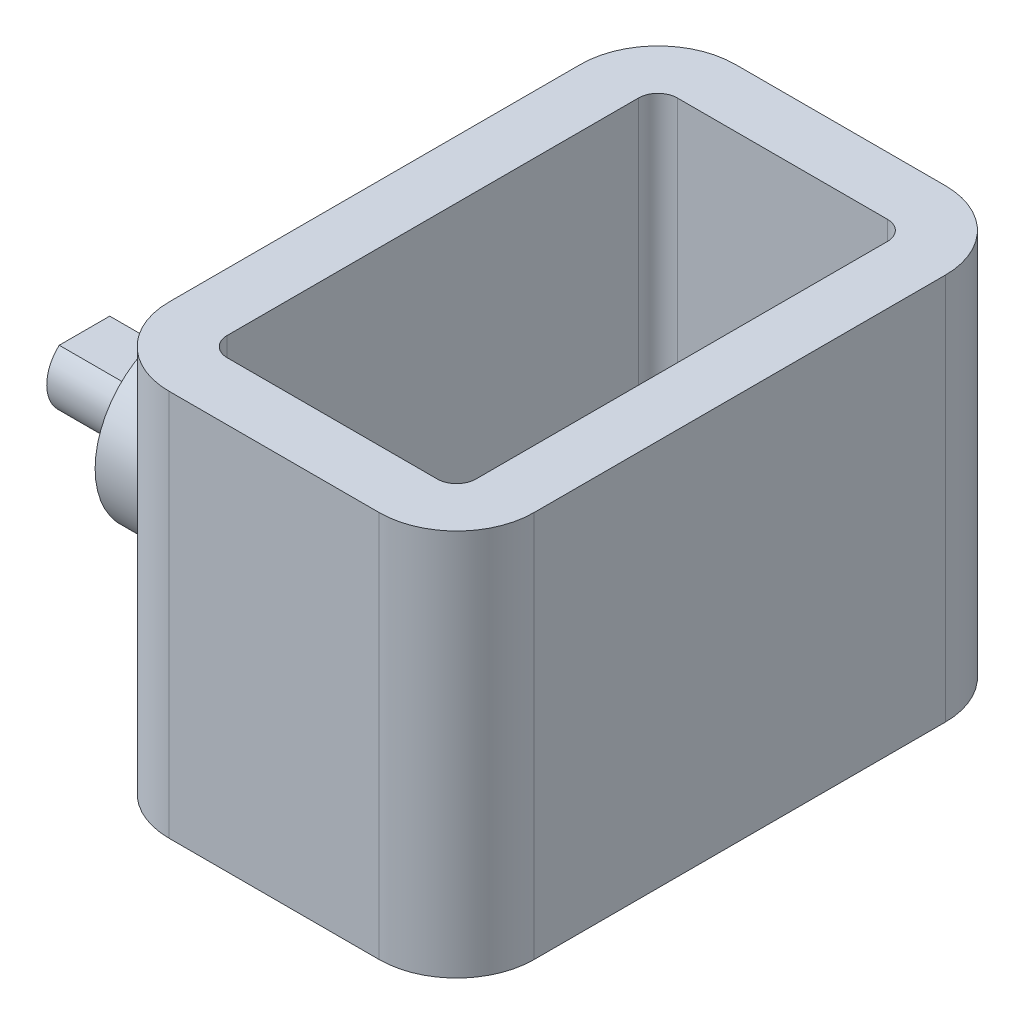
ISO-10303-21;
HEADER;
FILE_DESCRIPTION(('STEP AP214'),'2;1');
FILE_NAME('part.step','',(''),(''),'','','');
FILE_SCHEMA(('AUTOMOTIVE_DESIGN { 1 0 10303 214 1 1 1 1 }'));
ENDSEC;
DATA;
#1=APPLICATION_CONTEXT('core data for automotive mechanical design processes');
#2=APPLICATION_PROTOCOL_DEFINITION('international standard','automotive_design',2000,#1);
#3=PRODUCT_CONTEXT('',#1,'mechanical');
#4=PRODUCT('Part','Part','',(#3));
#5=PRODUCT_RELATED_PRODUCT_CATEGORY('part','',(#4));
#6=PRODUCT_DEFINITION_FORMATION('','',#4);
#7=PRODUCT_DEFINITION_CONTEXT('part definition',#1,'design');
#8=PRODUCT_DEFINITION('design','',#6,#7);
#9=PRODUCT_DEFINITION_SHAPE('','',#8);
#10=(LENGTH_UNIT() NAMED_UNIT(*) SI_UNIT(.MILLI.,.METRE.));
#11=(NAMED_UNIT(*) PLANE_ANGLE_UNIT() SI_UNIT($,.RADIAN.));
#12=(NAMED_UNIT(*) SI_UNIT($,.STERADIAN.) SOLID_ANGLE_UNIT());
#13=UNCERTAINTY_MEASURE_WITH_UNIT(LENGTH_MEASURE(1.E-05),#10,'distance_accuracy_value','');
#14=(GEOMETRIC_REPRESENTATION_CONTEXT(3) GLOBAL_UNCERTAINTY_ASSIGNED_CONTEXT((#13)) GLOBAL_UNIT_ASSIGNED_CONTEXT((#10,
#11,#12)) REPRESENTATION_CONTEXT('',''));
#15=CARTESIAN_POINT('',(0.,0.,0.));
#16=DIRECTION('',(0.,0.,1.));
#17=DIRECTION('',(1.,0.,0.));
#18=AXIS2_PLACEMENT_3D('',#15,#16,#17);
#19=CARTESIAN_POINT('',(-5.425,20.,-10.625));
#20=DIRECTION('',(0.,1.,0.));
#21=DIRECTION('',(0.,0.,1.));
#22=AXIS2_PLACEMENT_3D('',#19,#20,#21);
#23=PLANE('',#22);
#24=CARTESIAN_POINT('',(-5.425,20.,-10.625));
#25=DIRECTION('',(0.,1.,0.));
#26=DIRECTION('',(0.,0.,1.));
#27=AXIS2_PLACEMENT_3D('',#24,#25,#26);
#28=CIRCLE('',#27,4.);
#29=CARTESIAN_POINT('',(-5.425,20.,-14.625));
#30=VERTEX_POINT('',#29);
#31=CARTESIAN_POINT('',(-9.425,20.,-10.625));
#32=VERTEX_POINT('',#31);
#33=EDGE_CURVE('E288',#30,#32,#28,.T.);
#34=ORIENTED_EDGE('',*,*,#33,.T.);
#35=DIRECTION('',(0.,0.,1.));
#36=VECTOR('',#35,1.);
#37=CARTESIAN_POINT('',(-9.425,20.,-10.625));
#38=LINE('',#37,#36);
#39=CARTESIAN_POINT('',(-9.425,20.,10.625));
#40=VERTEX_POINT('',#39);
#41=EDGE_CURVE('E292',#32,#40,#38,.T.);
#42=ORIENTED_EDGE('',*,*,#41,.T.);
#43=CARTESIAN_POINT('',(-5.425,20.,10.625));
#44=DIRECTION('',(0.,1.,0.));
#45=DIRECTION('',(0.,0.,1.));
#46=AXIS2_PLACEMENT_3D('',#43,#44,#45);
#47=CIRCLE('',#46,4.);
#48=CARTESIAN_POINT('',(-5.425,20.,14.625));
#49=VERTEX_POINT('',#48);
#50=EDGE_CURVE('E296',#40,#49,#47,.T.);
#51=ORIENTED_EDGE('',*,*,#50,.T.);
#52=DIRECTION('',(1.,0.,0.));
#53=VECTOR('',#52,1.);
#54=CARTESIAN_POINT('',(-5.425,20.,14.625));
#55=LINE('',#54,#53);
#56=CARTESIAN_POINT('',(5.425,20.,14.625));
#57=VERTEX_POINT('',#56);
#58=EDGE_CURVE('E299',#49,#57,#55,.T.);
#59=ORIENTED_EDGE('',*,*,#58,.T.);
#60=CARTESIAN_POINT('',(5.425,20.,10.625));
#61=DIRECTION('',(0.,1.,0.));
#62=DIRECTION('',(0.,0.,1.));
#63=AXIS2_PLACEMENT_3D('',#60,#61,#62);
#64=CIRCLE('',#63,4.);
#65=CARTESIAN_POINT('',(9.425,20.,10.625));
#66=VERTEX_POINT('',#65);
#67=EDGE_CURVE('E302',#57,#66,#64,.T.);
#68=ORIENTED_EDGE('',*,*,#67,.T.);
#69=DIRECTION('',(0.,0.,-1.));
#70=VECTOR('',#69,1.);
#71=CARTESIAN_POINT('',(9.425,20.,-10.625));
#72=LINE('',#71,#70);
#73=CARTESIAN_POINT('',(9.425,20.,-10.625));
#74=VERTEX_POINT('',#73);
#75=EDGE_CURVE('E305',#66,#74,#72,.T.);
#76=ORIENTED_EDGE('',*,*,#75,.T.);
#77=CARTESIAN_POINT('',(5.425,20.,-10.625));
#78=DIRECTION('',(0.,1.,0.));
#79=DIRECTION('',(0.,0.,-1.));
#80=AXIS2_PLACEMENT_3D('',#77,#78,#79);
#81=CIRCLE('',#80,4.);
#82=CARTESIAN_POINT('',(5.425,20.,-14.625));
#83=VERTEX_POINT('',#82);
#84=EDGE_CURVE('E308',#74,#83,#81,.T.);
#85=ORIENTED_EDGE('',*,*,#84,.T.);
#86=DIRECTION('',(-1.,0.,0.));
#87=VECTOR('',#86,1.);
#88=CARTESIAN_POINT('',(-5.425,20.,-14.625));
#89=LINE('',#88,#87);
#90=EDGE_CURVE('E311',#83,#30,#89,.T.);
#91=ORIENTED_EDGE('',*,*,#90,.T.);
#92=EDGE_LOOP('',(#34,#42,#51,#59,#68,#76,#85,#91));
#93=FACE_BOUND('',#92,.T.);
#94=DIRECTION('',(1.,0.,0.));
#95=VECTOR('',#94,1.);
#96=CARTESIAN_POINT('',(-5.425,20.,11.625));
#97=LINE('',#96,#95);
#98=CARTESIAN_POINT('',(-5.425,20.,11.625));
#99=VERTEX_POINT('',#98);
#100=CARTESIAN_POINT('',(5.425,20.,11.625));
#101=VERTEX_POINT('',#100);
#102=EDGE_CURVE('E213',#99,#101,#97,.T.);
#103=ORIENTED_EDGE('',*,*,#102,.F.);
#104=CARTESIAN_POINT('',(-5.425,20.,10.625));
#105=DIRECTION('',(0.,1.,0.));
#106=DIRECTION('',(0.,0.,1.));
#107=AXIS2_PLACEMENT_3D('',#104,#105,#106);
#108=CIRCLE('',#107,1.);
#109=CARTESIAN_POINT('',(-6.425,20.,10.625));
#110=VERTEX_POINT('',#109);
#111=EDGE_CURVE('E210',#110,#99,#108,.T.);
#112=ORIENTED_EDGE('',*,*,#111,.F.);
#113=DIRECTION('',(0.,0.,1.));
#114=VECTOR('',#113,1.);
#115=CARTESIAN_POINT('',(-6.425,20.,-10.625));
#116=LINE('',#115,#114);
#117=CARTESIAN_POINT('',(-6.425,20.,-10.625));
#118=VERTEX_POINT('',#117);
#119=EDGE_CURVE('E232',#118,#110,#116,.T.);
#120=ORIENTED_EDGE('',*,*,#119,.F.);
#121=CARTESIAN_POINT('',(-5.425,20.,-10.625));
#122=DIRECTION('',(0.,1.,0.));
#123=DIRECTION('',(0.,0.,1.));
#124=AXIS2_PLACEMENT_3D('',#121,#122,#123);
#125=CIRCLE('',#124,0.999999999999999);
#126=CARTESIAN_POINT('',(-5.425,20.,-11.625));
#127=VERTEX_POINT('',#126);
#128=EDGE_CURVE('E229',#127,#118,#125,.T.);
#129=ORIENTED_EDGE('',*,*,#128,.F.);
#130=DIRECTION('',(-1.,0.,0.));
#131=VECTOR('',#130,1.);
#132=CARTESIAN_POINT('',(-5.425,20.,-11.625));
#133=LINE('',#132,#131);
#134=CARTESIAN_POINT('',(5.425,20.,-11.625));
#135=VERTEX_POINT('',#134);
#136=EDGE_CURVE('E226',#135,#127,#133,.T.);
#137=ORIENTED_EDGE('',*,*,#136,.F.);
#138=CARTESIAN_POINT('',(5.425,20.,-10.625));
#139=DIRECTION('',(0.,1.,0.));
#140=DIRECTION('',(0.,0.,-1.));
#141=AXIS2_PLACEMENT_3D('',#138,#139,#140);
#142=CIRCLE('',#141,0.999999999999998);
#143=CARTESIAN_POINT('',(6.425,20.,-10.625));
#144=VERTEX_POINT('',#143);
#145=EDGE_CURVE('E223',#144,#135,#142,.T.);
#146=ORIENTED_EDGE('',*,*,#145,.F.);
#147=DIRECTION('',(0.,0.,-1.));
#148=VECTOR('',#147,1.);
#149=CARTESIAN_POINT('',(6.425,20.,-10.625));
#150=LINE('',#149,#148);
#151=CARTESIAN_POINT('',(6.425,20.,10.625));
#152=VERTEX_POINT('',#151);
#153=EDGE_CURVE('E220',#152,#144,#150,.T.);
#154=ORIENTED_EDGE('',*,*,#153,.F.);
#155=CARTESIAN_POINT('',(5.425,20.,10.625));
#156=DIRECTION('',(0.,1.,0.));
#157=DIRECTION('',(0.,0.,1.));
#158=AXIS2_PLACEMENT_3D('',#155,#156,#157);
#159=CIRCLE('',#158,1.);
#160=EDGE_CURVE('E217',#101,#152,#159,.T.);
#161=ORIENTED_EDGE('',*,*,#160,.F.);
#162=EDGE_LOOP('',(#103,#112,#120,#129,#137,#146,#154,#161));
#163=FACE_BOUND('',#162,.T.);
#164=ADVANCED_FACE('F41',(#93,#163),#23,.T.);
#165=CARTESIAN_POINT('',(-5.425,0.,-10.625));
#166=DIRECTION('',(0.,1.,0.));
#167=DIRECTION('',(0.,0.,1.));
#168=AXIS2_PLACEMENT_3D('',#165,#166,#167);
#169=PLANE('',#168);
#170=CARTESIAN_POINT('',(-5.425,0.,-10.625));
#171=DIRECTION('',(0.,1.,0.));
#172=DIRECTION('',(0.,0.,1.));
#173=AXIS2_PLACEMENT_3D('',#170,#171,#172);
#174=CIRCLE('',#173,4.);
#175=CARTESIAN_POINT('',(-5.425,0.,-14.625));
#176=VERTEX_POINT('',#175);
#177=CARTESIAN_POINT('',(-9.425,0.,-10.625));
#178=VERTEX_POINT('',#177);
#179=EDGE_CURVE('E287',#176,#178,#174,.T.);
#180=ORIENTED_EDGE('',*,*,#179,.F.);
#181=DIRECTION('',(-1.,0.,0.));
#182=VECTOR('',#181,1.);
#183=CARTESIAN_POINT('',(-5.425,0.,-14.625));
#184=LINE('',#183,#182);
#185=CARTESIAN_POINT('',(5.425,0.,-14.625));
#186=VERTEX_POINT('',#185);
#187=EDGE_CURVE('E293',#186,#176,#184,.T.);
#188=ORIENTED_EDGE('',*,*,#187,.F.);
#189=CARTESIAN_POINT('',(5.425,0.,-10.625));
#190=DIRECTION('',(0.,1.,0.));
#191=DIRECTION('',(0.,0.,-1.));
#192=AXIS2_PLACEMENT_3D('',#189,#190,#191);
#193=CIRCLE('',#192,4.);
#194=CARTESIAN_POINT('',(9.425,0.,-10.625));
#195=VERTEX_POINT('',#194);
#196=EDGE_CURVE('E334',#195,#186,#193,.T.);
#197=ORIENTED_EDGE('',*,*,#196,.F.);
#198=DIRECTION('',(0.,0.,-1.));
#199=VECTOR('',#198,1.);
#200=CARTESIAN_POINT('',(9.425,0.,-10.625));
#201=LINE('',#200,#199);
#202=CARTESIAN_POINT('',(9.425,0.,10.625));
#203=VERTEX_POINT('',#202);
#204=EDGE_CURVE('E331',#203,#195,#201,.T.);
#205=ORIENTED_EDGE('',*,*,#204,.F.);
#206=CARTESIAN_POINT('',(5.425,0.,10.625));
#207=DIRECTION('',(0.,1.,0.));
#208=DIRECTION('',(0.,0.,1.));
#209=AXIS2_PLACEMENT_3D('',#206,#207,#208);
#210=CIRCLE('',#209,4.);
#211=CARTESIAN_POINT('',(5.425,0.,14.625));
#212=VERTEX_POINT('',#211);
#213=EDGE_CURVE('E328',#212,#203,#210,.T.);
#214=ORIENTED_EDGE('',*,*,#213,.F.);
#215=DIRECTION('',(1.,0.,0.));
#216=VECTOR('',#215,1.);
#217=CARTESIAN_POINT('',(-5.425,0.,14.625));
#218=LINE('',#217,#216);
#219=CARTESIAN_POINT('',(-5.425,0.,14.625));
#220=VERTEX_POINT('',#219);
#221=EDGE_CURVE('E325',#220,#212,#218,.T.);
#222=ORIENTED_EDGE('',*,*,#221,.F.);
#223=CARTESIAN_POINT('',(-5.425,0.,10.625));
#224=DIRECTION('',(0.,1.,0.));
#225=DIRECTION('',(0.,0.,1.));
#226=AXIS2_PLACEMENT_3D('',#223,#224,#225);
#227=CIRCLE('',#226,4.);
#228=CARTESIAN_POINT('',(-9.425,0.,10.625));
#229=VERTEX_POINT('',#228);
#230=EDGE_CURVE('E322',#229,#220,#227,.T.);
#231=ORIENTED_EDGE('',*,*,#230,.F.);
#232=DIRECTION('',(0.,0.,1.));
#233=VECTOR('',#232,1.);
#234=CARTESIAN_POINT('',(-9.425,0.,-10.625));
#235=LINE('',#234,#233);
#236=CARTESIAN_POINT('',(-9.425,0.,0.));
#237=VERTEX_POINT('',#236);
#238=EDGE_CURVE('E318',#237,#229,#235,.T.);
#239=ORIENTED_EDGE('',*,*,#238,.F.);
#240=EDGE_CURVE('E319',#178,#237,#235,.T.);
#241=ORIENTED_EDGE('',*,*,#240,.F.);
#242=EDGE_LOOP('',(#180,#188,#197,#205,#214,#222,#231,#239,#241));
#243=FACE_BOUND('',#242,.T.);
#244=CARTESIAN_POINT('',(-5.425,0.,10.625));
#245=DIRECTION('',(0.,1.,0.));
#246=DIRECTION('',(0.,0.,1.));
#247=AXIS2_PLACEMENT_3D('',#244,#245,#246);
#248=CIRCLE('',#247,1.);
#249=CARTESIAN_POINT('',(-6.425,0.,10.625));
#250=VERTEX_POINT('',#249);
#251=CARTESIAN_POINT('',(-5.425,0.,11.625));
#252=VERTEX_POINT('',#251);
#253=EDGE_CURVE('E65',#250,#252,#248,.T.);
#254=ORIENTED_EDGE('',*,*,#253,.T.);
#255=DIRECTION('',(1.,0.,0.));
#256=VECTOR('',#255,1.);
#257=CARTESIAN_POINT('',(-5.425,0.,11.625));
#258=LINE('',#257,#256);
#259=CARTESIAN_POINT('',(5.425,0.,11.625));
#260=VERTEX_POINT('',#259);
#261=EDGE_CURVE('E238',#252,#260,#258,.T.);
#262=ORIENTED_EDGE('',*,*,#261,.T.);
#263=CARTESIAN_POINT('',(5.425,0.,10.625));
#264=DIRECTION('',(0.,1.,0.));
#265=DIRECTION('',(0.,0.,1.));
#266=AXIS2_PLACEMENT_3D('',#263,#264,#265);
#267=CIRCLE('',#266,1.);
#268=CARTESIAN_POINT('',(6.425,0.,10.625));
#269=VERTEX_POINT('',#268);
#270=EDGE_CURVE('E242',#260,#269,#267,.T.);
#271=ORIENTED_EDGE('',*,*,#270,.T.);
#272=DIRECTION('',(0.,0.,-1.));
#273=VECTOR('',#272,1.);
#274=CARTESIAN_POINT('',(6.425,0.,-10.625));
#275=LINE('',#274,#273);
#276=CARTESIAN_POINT('',(6.425,0.,-10.625));
#277=VERTEX_POINT('',#276);
#278=EDGE_CURVE('E246',#269,#277,#275,.T.);
#279=ORIENTED_EDGE('',*,*,#278,.T.);
#280=CARTESIAN_POINT('',(5.425,0.,-10.625));
#281=DIRECTION('',(0.,1.,0.));
#282=DIRECTION('',(0.,0.,-1.));
#283=AXIS2_PLACEMENT_3D('',#280,#281,#282);
#284=CIRCLE('',#283,0.999999999999998);
#285=CARTESIAN_POINT('',(5.425,0.,-11.625));
#286=VERTEX_POINT('',#285);
#287=EDGE_CURVE('E250',#277,#286,#284,.T.);
#288=ORIENTED_EDGE('',*,*,#287,.T.);
#289=DIRECTION('',(-1.,0.,0.));
#290=VECTOR('',#289,1.);
#291=CARTESIAN_POINT('',(-5.425,0.,-11.625));
#292=LINE('',#291,#290);
#293=CARTESIAN_POINT('',(-5.425,0.,-11.625));
#294=VERTEX_POINT('',#293);
#295=EDGE_CURVE('E254',#286,#294,#292,.T.);
#296=ORIENTED_EDGE('',*,*,#295,.T.);
#297=CARTESIAN_POINT('',(-5.425,0.,-10.625));
#298=DIRECTION('',(0.,1.,0.));
#299=DIRECTION('',(0.,0.,1.));
#300=AXIS2_PLACEMENT_3D('',#297,#298,#299);
#301=CIRCLE('',#300,0.999999999999999);
#302=CARTESIAN_POINT('',(-6.425,0.,-10.625));
#303=VERTEX_POINT('',#302);
#304=EDGE_CURVE('E258',#294,#303,#301,.T.);
#305=ORIENTED_EDGE('',*,*,#304,.T.);
#306=DIRECTION('',(0.,0.,1.));
#307=VECTOR('',#306,1.);
#308=CARTESIAN_POINT('',(-6.425,0.,-10.625));
#309=LINE('',#308,#307);
#310=EDGE_CURVE('E214',#303,#250,#309,.T.);
#311=ORIENTED_EDGE('',*,*,#310,.T.);
#312=EDGE_LOOP('',(#254,#262,#271,#279,#288,#296,#305,#311));
#313=FACE_BOUND('',#312,.T.);
#314=ADVANCED_FACE('F374',(#243,#313),#169,.F.);
#315=CARTESIAN_POINT('',(-5.425,20.,-10.625));
#316=DIRECTION('',(0.,-1.,0.));
#317=DIRECTION('',(0.,0.,-1.));
#318=AXIS2_PLACEMENT_3D('',#315,#316,#317);
#319=CYLINDRICAL_SURFACE('',#318,4.);
#320=ORIENTED_EDGE('',*,*,#179,.T.);
#321=DIRECTION('',(0.,-1.,0.));
#322=VECTOR('',#321,1.);
#323=CARTESIAN_POINT('',(-9.425,20.,-10.625));
#324=LINE('',#323,#322);
#325=EDGE_CURVE('E11',#32,#178,#324,.T.);
#326=ORIENTED_EDGE('',*,*,#325,.F.);
#327=ORIENTED_EDGE('',*,*,#33,.F.);
#328=DIRECTION('',(0.,-1.,0.));
#329=VECTOR('',#328,1.);
#330=CARTESIAN_POINT('',(-5.425,20.,-14.625));
#331=LINE('',#330,#329);
#332=EDGE_CURVE('E314',#30,#176,#331,.T.);
#333=ORIENTED_EDGE('',*,*,#332,.T.);
#334=EDGE_LOOP('',(#320,#326,#327,#333));
#335=FACE_BOUND('',#334,.T.);
#336=ADVANCED_FACE('F43',(#335),#319,.T.);
#337=CARTESIAN_POINT('',(-9.425,20.,-10.625));
#338=DIRECTION('',(1.,0.,0.));
#339=DIRECTION('',(0.,0.,-1.));
#340=AXIS2_PLACEMENT_3D('',#337,#338,#339);
#341=PLANE('',#340);
#342=ORIENTED_EDGE('',*,*,#240,.T.);
#343=CARTESIAN_POINT('',(-9.425,4.45,0.));
#344=DIRECTION('',(-1.,0.,0.));
#345=DIRECTION('',(0.,0.,1.));
#346=AXIS2_PLACEMENT_3D('',#343,#344,#345);
#347=CIRCLE('',#346,4.45);
#348=EDGE_CURVE('E193',#237,#237,#347,.T.);
#349=ORIENTED_EDGE('',*,*,#348,.F.);
#350=ORIENTED_EDGE('',*,*,#238,.T.);
#351=DIRECTION('',(0.,-1.,0.));
#352=VECTOR('',#351,1.);
#353=CARTESIAN_POINT('',(-9.425,20.,10.625));
#354=LINE('',#353,#352);
#355=EDGE_CURVE('E50',#40,#229,#354,.T.);
#356=ORIENTED_EDGE('',*,*,#355,.F.);
#357=ORIENTED_EDGE('',*,*,#41,.F.);
#358=ORIENTED_EDGE('',*,*,#325,.T.);
#359=EDGE_LOOP('',(#342,#349,#350,#356,#357,#358));
#360=FACE_BOUND('',#359,.T.);
#361=ADVANCED_FACE('F393',(#360),#341,.F.);
#362=CARTESIAN_POINT('',(-5.425,20.,10.625));
#363=DIRECTION('',(0.,-1.,0.));
#364=DIRECTION('',(0.,0.,-1.));
#365=AXIS2_PLACEMENT_3D('',#362,#363,#364);
#366=CYLINDRICAL_SURFACE('',#365,4.);
#367=ORIENTED_EDGE('',*,*,#230,.T.);
#368=DIRECTION('',(0.,-1.,0.));
#369=VECTOR('',#368,1.);
#370=CARTESIAN_POINT('',(-5.425,20.,14.625));
#371=LINE('',#370,#369);
#372=EDGE_CURVE('E358',#49,#220,#371,.T.);
#373=ORIENTED_EDGE('',*,*,#372,.F.);
#374=ORIENTED_EDGE('',*,*,#50,.F.);
#375=ORIENTED_EDGE('',*,*,#355,.T.);
#376=EDGE_LOOP('',(#367,#373,#374,#375));
#377=FACE_BOUND('',#376,.T.);
#378=ADVANCED_FACE('F367',(#377),#366,.T.);
#379=CARTESIAN_POINT('',(-5.425,20.,14.625));
#380=DIRECTION('',(0.,0.,-1.));
#381=DIRECTION('',(-1.,0.,0.));
#382=AXIS2_PLACEMENT_3D('',#379,#380,#381);
#383=PLANE('',#382);
#384=ORIENTED_EDGE('',*,*,#221,.T.);
#385=DIRECTION('',(0.,-1.,0.));
#386=VECTOR('',#385,1.);
#387=CARTESIAN_POINT('',(5.425,20.,14.625));
#388=LINE('',#387,#386);
#389=EDGE_CURVE('E354',#57,#212,#388,.T.);
#390=ORIENTED_EDGE('',*,*,#389,.F.);
#391=ORIENTED_EDGE('',*,*,#58,.F.);
#392=ORIENTED_EDGE('',*,*,#372,.T.);
#393=EDGE_LOOP('',(#384,#390,#391,#392));
#394=FACE_BOUND('',#393,.T.);
#395=ADVANCED_FACE('F381',(#394),#383,.F.);
#396=CARTESIAN_POINT('',(5.425,20.,10.625));
#397=DIRECTION('',(0.,-1.,0.));
#398=DIRECTION('',(0.,0.,-1.));
#399=AXIS2_PLACEMENT_3D('',#396,#397,#398);
#400=CYLINDRICAL_SURFACE('',#399,4.);
#401=ORIENTED_EDGE('',*,*,#213,.T.);
#402=DIRECTION('',(0.,-1.,0.));
#403=VECTOR('',#402,1.);
#404=CARTESIAN_POINT('',(9.425,20.,10.625));
#405=LINE('',#404,#403);
#406=EDGE_CURVE('E350',#66,#203,#405,.T.);
#407=ORIENTED_EDGE('',*,*,#406,.F.);
#408=ORIENTED_EDGE('',*,*,#67,.F.);
#409=ORIENTED_EDGE('',*,*,#389,.T.);
#410=EDGE_LOOP('',(#401,#407,#408,#409));
#411=FACE_BOUND('',#410,.T.);
#412=ADVANCED_FACE('F385',(#411),#400,.T.);
#413=CARTESIAN_POINT('',(9.425,20.,-10.625));
#414=DIRECTION('',(-1.,0.,0.));
#415=DIRECTION('',(0.,0.,1.));
#416=AXIS2_PLACEMENT_3D('',#413,#414,#415);
#417=PLANE('',#416);
#418=ORIENTED_EDGE('',*,*,#204,.T.);
#419=DIRECTION('',(0.,-1.,0.));
#420=VECTOR('',#419,1.);
#421=CARTESIAN_POINT('',(9.425,20.,-10.625));
#422=LINE('',#421,#420);
#423=EDGE_CURVE('E346',#74,#195,#422,.T.);
#424=ORIENTED_EDGE('',*,*,#423,.F.);
#425=ORIENTED_EDGE('',*,*,#75,.F.);
#426=ORIENTED_EDGE('',*,*,#406,.T.);
#427=EDGE_LOOP('',(#418,#424,#425,#426));
#428=FACE_BOUND('',#427,.T.);
#429=ADVANCED_FACE('F406',(#428),#417,.F.);
#430=CARTESIAN_POINT('',(5.425,20.,-10.625));
#431=DIRECTION('',(0.,-1.,0.));
#432=DIRECTION('',(0.,0.,-1.));
#433=AXIS2_PLACEMENT_3D('',#430,#431,#432);
#434=CYLINDRICAL_SURFACE('',#433,4.);
#435=ORIENTED_EDGE('',*,*,#196,.T.);
#436=DIRECTION('',(0.,-1.,0.));
#437=VECTOR('',#436,1.);
#438=CARTESIAN_POINT('',(5.425,20.,-14.625));
#439=LINE('',#438,#437);
#440=EDGE_CURVE('E342',#83,#186,#439,.T.);
#441=ORIENTED_EDGE('',*,*,#440,.F.);
#442=ORIENTED_EDGE('',*,*,#84,.F.);
#443=ORIENTED_EDGE('',*,*,#423,.T.);
#444=EDGE_LOOP('',(#435,#441,#442,#443));
#445=FACE_BOUND('',#444,.T.);
#446=ADVANCED_FACE('F404',(#445),#434,.T.);
#447=CARTESIAN_POINT('',(-5.425,20.,-14.625));
#448=DIRECTION('',(0.,0.,1.));
#449=DIRECTION('',(1.,0.,0.));
#450=AXIS2_PLACEMENT_3D('',#447,#448,#449);
#451=PLANE('',#450);
#452=ORIENTED_EDGE('',*,*,#187,.T.);
#453=ORIENTED_EDGE('',*,*,#332,.F.);
#454=ORIENTED_EDGE('',*,*,#90,.F.);
#455=ORIENTED_EDGE('',*,*,#440,.T.);
#456=EDGE_LOOP('',(#452,#453,#454,#455));
#457=FACE_BOUND('',#456,.T.);
#458=ADVANCED_FACE('F399',(#457),#451,.F.);
#459=CARTESIAN_POINT('',(-5.425,20.,10.625));
#460=DIRECTION('',(0.,-1.,0.));
#461=DIRECTION('',(0.,0.,-1.));
#462=AXIS2_PLACEMENT_3D('',#459,#460,#461);
#463=CYLINDRICAL_SURFACE('',#462,1.);
#464=ORIENTED_EDGE('',*,*,#253,.F.);
#465=DIRECTION('',(0.,-1.,0.));
#466=VECTOR('',#465,1.);
#467=CARTESIAN_POINT('',(-6.425,20.,10.625));
#468=LINE('',#467,#466);
#469=EDGE_CURVE('E235',#110,#250,#468,.T.);
#470=ORIENTED_EDGE('',*,*,#469,.F.);
#471=ORIENTED_EDGE('',*,*,#111,.T.);
#472=DIRECTION('',(0.,-1.,0.));
#473=VECTOR('',#472,1.);
#474=CARTESIAN_POINT('',(-5.425,20.,11.625));
#475=LINE('',#474,#473);
#476=EDGE_CURVE('E284',#99,#252,#475,.T.);
#477=ORIENTED_EDGE('',*,*,#476,.T.);
#478=EDGE_LOOP('',(#464,#470,#471,#477));
#479=FACE_BOUND('',#478,.T.);
#480=ADVANCED_FACE('F422',(#479),#463,.F.);
#481=CARTESIAN_POINT('',(-5.425,20.,11.625));
#482=DIRECTION('',(0.,0.,-1.));
#483=DIRECTION('',(-1.,0.,0.));
#484=AXIS2_PLACEMENT_3D('',#481,#482,#483);
#485=PLANE('',#484);
#486=ORIENTED_EDGE('',*,*,#261,.F.);
#487=ORIENTED_EDGE('',*,*,#476,.F.);
#488=ORIENTED_EDGE('',*,*,#102,.T.);
#489=DIRECTION('',(0.,-1.,0.));
#490=VECTOR('',#489,1.);
#491=CARTESIAN_POINT('',(5.425,20.,11.625));
#492=LINE('',#491,#490);
#493=EDGE_CURVE('E281',#101,#260,#492,.T.);
#494=ORIENTED_EDGE('',*,*,#493,.T.);
#495=EDGE_LOOP('',(#486,#487,#488,#494));
#496=FACE_BOUND('',#495,.T.);
#497=ADVANCED_FACE('F429',(#496),#485,.T.);
#498=CARTESIAN_POINT('',(5.425,20.,10.625));
#499=DIRECTION('',(0.,-1.,0.));
#500=DIRECTION('',(0.,0.,-1.));
#501=AXIS2_PLACEMENT_3D('',#498,#499,#500);
#502=CYLINDRICAL_SURFACE('',#501,1.);
#503=ORIENTED_EDGE('',*,*,#270,.F.);
#504=ORIENTED_EDGE('',*,*,#493,.F.);
#505=ORIENTED_EDGE('',*,*,#160,.T.);
#506=DIRECTION('',(0.,-1.,0.));
#507=VECTOR('',#506,1.);
#508=CARTESIAN_POINT('',(6.425,20.,10.625));
#509=LINE('',#508,#507);
#510=EDGE_CURVE('E278',#152,#269,#509,.T.);
#511=ORIENTED_EDGE('',*,*,#510,.T.);
#512=EDGE_LOOP('',(#503,#504,#505,#511));
#513=FACE_BOUND('',#512,.T.);
#514=ADVANCED_FACE('F433',(#513),#502,.F.);
#515=CARTESIAN_POINT('',(6.425,20.,-10.625));
#516=DIRECTION('',(-1.,0.,0.));
#517=DIRECTION('',(0.,0.,1.));
#518=AXIS2_PLACEMENT_3D('',#515,#516,#517);
#519=PLANE('',#518);
#520=ORIENTED_EDGE('',*,*,#278,.F.);
#521=ORIENTED_EDGE('',*,*,#510,.F.);
#522=ORIENTED_EDGE('',*,*,#153,.T.);
#523=DIRECTION('',(0.,-1.,0.));
#524=VECTOR('',#523,1.);
#525=CARTESIAN_POINT('',(6.425,20.,-10.625));
#526=LINE('',#525,#524);
#527=EDGE_CURVE('E275',#144,#277,#526,.T.);
#528=ORIENTED_EDGE('',*,*,#527,.T.);
#529=EDGE_LOOP('',(#520,#521,#522,#528));
#530=FACE_BOUND('',#529,.T.);
#531=ADVANCED_FACE('F438',(#530),#519,.T.);
#532=CARTESIAN_POINT('',(5.425,20.,-10.625));
#533=DIRECTION('',(0.,-1.,0.));
#534=DIRECTION('',(0.,0.,-1.));
#535=AXIS2_PLACEMENT_3D('',#532,#533,#534);
#536=CYLINDRICAL_SURFACE('',#535,0.999999999999998);
#537=ORIENTED_EDGE('',*,*,#287,.F.);
#538=ORIENTED_EDGE('',*,*,#527,.F.);
#539=ORIENTED_EDGE('',*,*,#145,.T.);
#540=DIRECTION('',(0.,-1.,0.));
#541=VECTOR('',#540,1.);
#542=CARTESIAN_POINT('',(5.425,20.,-11.625));
#543=LINE('',#542,#541);
#544=EDGE_CURVE('E272',#135,#286,#543,.T.);
#545=ORIENTED_EDGE('',*,*,#544,.T.);
#546=EDGE_LOOP('',(#537,#538,#539,#545));
#547=FACE_BOUND('',#546,.T.);
#548=ADVANCED_FACE('F444',(#547),#536,.F.);
#549=CARTESIAN_POINT('',(-5.425,20.,-11.625));
#550=DIRECTION('',(0.,0.,1.));
#551=DIRECTION('',(1.,0.,0.));
#552=AXIS2_PLACEMENT_3D('',#549,#550,#551);
#553=PLANE('',#552);
#554=ORIENTED_EDGE('',*,*,#295,.F.);
#555=ORIENTED_EDGE('',*,*,#544,.F.);
#556=ORIENTED_EDGE('',*,*,#136,.T.);
#557=DIRECTION('',(0.,-1.,0.));
#558=VECTOR('',#557,1.);
#559=CARTESIAN_POINT('',(-5.425,20.,-11.625));
#560=LINE('',#559,#558);
#561=EDGE_CURVE('E269',#127,#294,#560,.T.);
#562=ORIENTED_EDGE('',*,*,#561,.T.);
#563=EDGE_LOOP('',(#554,#555,#556,#562));
#564=FACE_BOUND('',#563,.T.);
#565=ADVANCED_FACE('F448',(#564),#553,.T.);
#566=CARTESIAN_POINT('',(-5.425,20.,-10.625));
#567=DIRECTION('',(0.,-1.,0.));
#568=DIRECTION('',(0.,0.,-1.));
#569=AXIS2_PLACEMENT_3D('',#566,#567,#568);
#570=CYLINDRICAL_SURFACE('',#569,0.999999999999999);
#571=ORIENTED_EDGE('',*,*,#304,.F.);
#572=ORIENTED_EDGE('',*,*,#561,.F.);
#573=ORIENTED_EDGE('',*,*,#128,.T.);
#574=DIRECTION('',(0.,-1.,0.));
#575=VECTOR('',#574,1.);
#576=CARTESIAN_POINT('',(-6.425,20.,-10.625));
#577=LINE('',#576,#575);
#578=EDGE_CURVE('E57',#118,#303,#577,.T.);
#579=ORIENTED_EDGE('',*,*,#578,.T.);
#580=EDGE_LOOP('',(#571,#572,#573,#579));
#581=FACE_BOUND('',#580,.T.);
#582=ADVANCED_FACE('F452',(#581),#570,.F.);
#583=CARTESIAN_POINT('',(-6.425,20.,-10.625));
#584=DIRECTION('',(1.,0.,0.));
#585=DIRECTION('',(0.,0.,-1.));
#586=AXIS2_PLACEMENT_3D('',#583,#584,#585);
#587=PLANE('',#586);
#588=ORIENTED_EDGE('',*,*,#310,.F.);
#589=ORIENTED_EDGE('',*,*,#578,.F.);
#590=ORIENTED_EDGE('',*,*,#119,.T.);
#591=ORIENTED_EDGE('',*,*,#469,.T.);
#592=EDGE_LOOP('',(#588,#589,#590,#591));
#593=FACE_BOUND('',#592,.T.);
#594=ADVANCED_FACE('F456',(#593),#587,.T.);
#595=CARTESIAN_POINT('',(-19.425,4.45,0.));
#596=DIRECTION('',(1.,0.,0.));
#597=DIRECTION('',(0.,0.,-1.));
#598=AXIS2_PLACEMENT_3D('',#595,#596,#597);
#599=CYLINDRICAL_SURFACE('',#598,4.45);
#600=CARTESIAN_POINT('',(-19.425,4.45,0.));
#601=DIRECTION('',(-1.,0.,0.));
#602=DIRECTION('',(0.,0.,1.));
#603=AXIS2_PLACEMENT_3D('',#600,#601,#602);
#604=CIRCLE('',#603,4.45);
#605=CARTESIAN_POINT('',(-19.425,4.45,4.45));
#606=VERTEX_POINT('',#605);
#607=EDGE_CURVE('E206',#606,#606,#604,.T.);
#608=ORIENTED_EDGE('',*,*,#607,.F.);
#609=EDGE_LOOP('',(#608));
#610=FACE_BOUND('',#609,.T.);
#611=ORIENTED_EDGE('',*,*,#348,.T.);
#612=EDGE_LOOP('',(#611));
#613=FACE_BOUND('',#612,.T.);
#614=ADVANCED_FACE('F460',(#610,#613),#599,.T.);
#615=CARTESIAN_POINT('',(-19.425,0.,0.));
#616=DIRECTION('',(-1.,0.,0.));
#617=DIRECTION('',(0.,0.,1.));
#618=AXIS2_PLACEMENT_3D('',#615,#616,#617);
#619=PLANE('',#618);
#620=CARTESIAN_POINT('',(-19.425,4.45,0.));
#621=DIRECTION('',(-1.,0.,0.));
#622=DIRECTION('',(0.,0.,1.));
#623=AXIS2_PLACEMENT_3D('',#620,#621,#622);
#624=CIRCLE('',#623,1.95);
#625=CARTESIAN_POINT('',(-19.425,5.9,-1.30384048104053));
#626=VERTEX_POINT('',#625);
#627=CARTESIAN_POINT('',(-19.425,5.9,1.30384048104053));
#628=VERTEX_POINT('',#627);
#629=EDGE_CURVE('E198',#626,#628,#624,.T.);
#630=ORIENTED_EDGE('',*,*,#629,.F.);
#631=DIRECTION('',(0.,0.,-1.));
#632=VECTOR('',#631,1.);
#633=CARTESIAN_POINT('',(-19.425,5.9,0.));
#634=LINE('',#633,#632);
#635=EDGE_CURVE('E191',#628,#626,#634,.T.);
#636=ORIENTED_EDGE('',*,*,#635,.F.);
#637=EDGE_LOOP('',(#630,#636));
#638=FACE_BOUND('',#637,.T.);
#639=ORIENTED_EDGE('',*,*,#607,.T.);
#640=EDGE_LOOP('',(#639));
#641=FACE_BOUND('',#640,.T.);
#642=ADVANCED_FACE('F463',(#638,#641),#619,.T.);
#643=CARTESIAN_POINT('',(-24.425,5.9,0.));
#644=DIRECTION('',(0.,-1.,0.));
#645=DIRECTION('',(0.,0.,-1.));
#646=AXIS2_PLACEMENT_3D('',#643,#644,#645);
#647=PLANE('',#646);
#648=ORIENTED_EDGE('',*,*,#635,.T.);
#649=DIRECTION('',(1.,0.,0.));
#650=VECTOR('',#649,1.);
#651=CARTESIAN_POINT('',(-24.425,5.9,-1.30384048104053));
#652=LINE('',#651,#650);
#653=CARTESIAN_POINT('',(-24.425,5.9,-1.30384048104053));
#654=VERTEX_POINT('',#653);
#655=EDGE_CURVE('E177',#654,#626,#652,.T.);
#656=ORIENTED_EDGE('',*,*,#655,.F.);
#657=DIRECTION('',(0.,0.,-1.));
#658=VECTOR('',#657,1.);
#659=CARTESIAN_POINT('',(-24.425,5.9,0.));
#660=LINE('',#659,#658);
#661=CARTESIAN_POINT('',(-24.425,5.9,1.30384048104053));
#662=VERTEX_POINT('',#661);
#663=EDGE_CURVE('E183',#662,#654,#660,.T.);
#664=ORIENTED_EDGE('',*,*,#663,.F.);
#665=DIRECTION('',(1.,0.,0.));
#666=VECTOR('',#665,1.);
#667=CARTESIAN_POINT('',(-24.425,5.9,1.30384048104053));
#668=LINE('',#667,#666);
#669=EDGE_CURVE('E179',#662,#628,#668,.T.);
#670=ORIENTED_EDGE('',*,*,#669,.T.);
#671=EDGE_LOOP('',(#648,#656,#664,#670));
#672=FACE_BOUND('',#671,.T.);
#673=ADVANCED_FACE('F190',(#672),#647,.F.);
#674=CARTESIAN_POINT('',(-24.425,4.45,0.));
#675=DIRECTION('',(1.,0.,0.));
#676=DIRECTION('',(0.,0.,-1.));
#677=AXIS2_PLACEMENT_3D('',#674,#675,#676);
#678=CYLINDRICAL_SURFACE('',#677,1.95);
#679=ORIENTED_EDGE('',*,*,#629,.T.);
#680=ORIENTED_EDGE('',*,*,#669,.F.);
#681=CARTESIAN_POINT('',(-24.425,4.45,0.));
#682=DIRECTION('',(-1.,0.,0.));
#683=DIRECTION('',(0.,0.,1.));
#684=AXIS2_PLACEMENT_3D('',#681,#682,#683);
#685=CIRCLE('',#684,1.95);
#686=EDGE_CURVE('E172',#654,#662,#685,.T.);
#687=ORIENTED_EDGE('',*,*,#686,.F.);
#688=ORIENTED_EDGE('',*,*,#655,.T.);
#689=EDGE_LOOP('',(#679,#680,#687,#688));
#690=FACE_BOUND('',#689,.T.);
#691=ADVANCED_FACE('F175',(#690),#678,.T.);
#692=CARTESIAN_POINT('',(-24.425,0.,0.));
#693=DIRECTION('',(-1.,0.,0.));
#694=DIRECTION('',(0.,0.,1.));
#695=AXIS2_PLACEMENT_3D('',#692,#693,#694);
#696=PLANE('',#695);
#697=ORIENTED_EDGE('',*,*,#663,.T.);
#698=ORIENTED_EDGE('',*,*,#686,.T.);
#699=EDGE_LOOP('',(#697,#698));
#700=FACE_BOUND('',#699,.T.);
#701=ADVANCED_FACE('F185',(#700),#696,.T.);
#702=CLOSED_SHELL('',(#164,#314,#336,#361,#378,#395,#412,#429,#446,#458,#480,#497,#514,#531,
#548,#565,#582,#594,#614,#642,#673,#691,#701));
#703=MANIFOLD_SOLID_BREP('B2',#702);
#704=ADVANCED_BREP_SHAPE_REPRESENTATION('',(#18,#703),#14);
#705=SHAPE_DEFINITION_REPRESENTATION(#9,#704);
ENDSEC;
END-ISO-10303-21;
